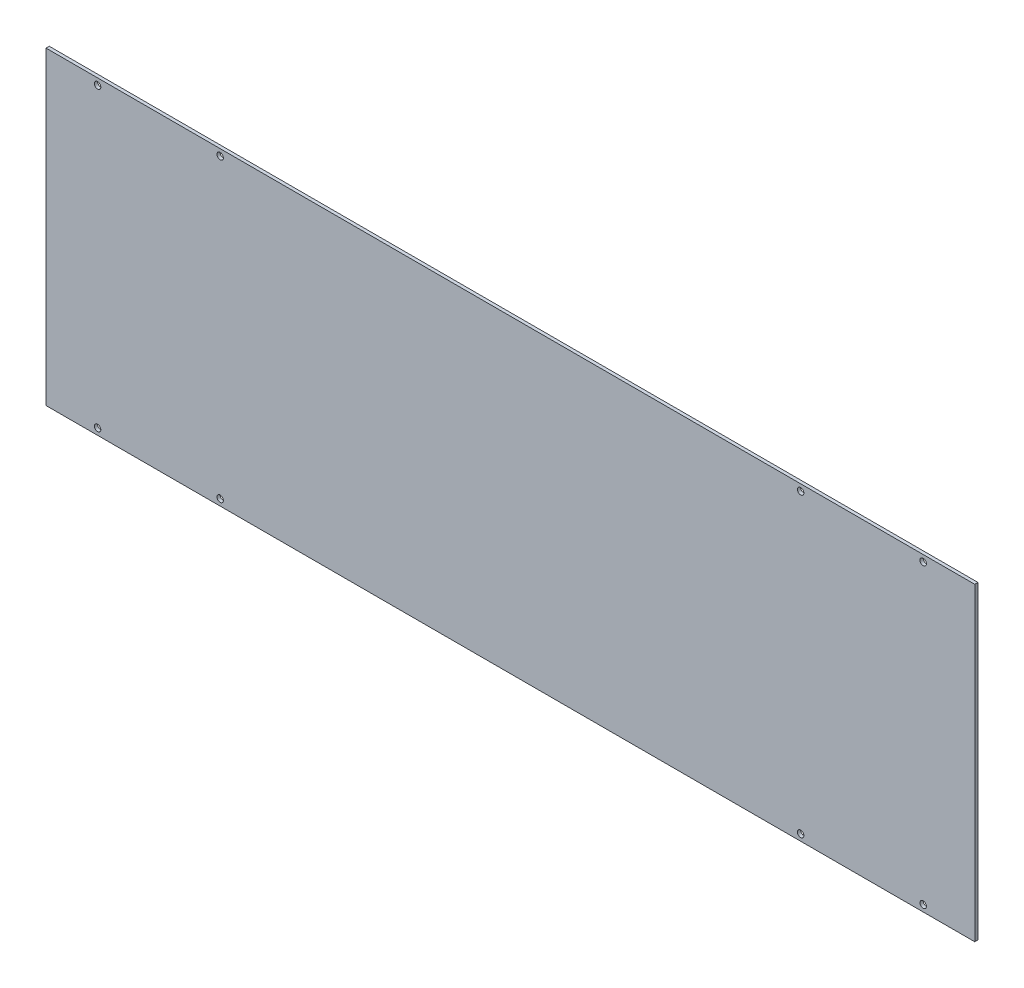
ISO-10303-21;
HEADER;
FILE_DESCRIPTION(('STEP AP214'),'2;1');
FILE_NAME('part.step','',(''),(''),'','','');
FILE_SCHEMA(('AUTOMOTIVE_DESIGN { 1 0 10303 214 1 1 1 1 }'));
ENDSEC;
DATA;
#1=APPLICATION_CONTEXT('core data for automotive mechanical design processes');
#2=APPLICATION_PROTOCOL_DEFINITION('international standard','automotive_design',2000,#1);
#3=PRODUCT_CONTEXT('',#1,'mechanical');
#4=PRODUCT('Part','Part','',(#3));
#5=PRODUCT_RELATED_PRODUCT_CATEGORY('part','',(#4));
#6=PRODUCT_DEFINITION_FORMATION('','',#4);
#7=PRODUCT_DEFINITION_CONTEXT('part definition',#1,'design');
#8=PRODUCT_DEFINITION('design','',#6,#7);
#9=PRODUCT_DEFINITION_SHAPE('','',#8);
#10=(LENGTH_UNIT() NAMED_UNIT(*) SI_UNIT(.MILLI.,.METRE.));
#11=(NAMED_UNIT(*) PLANE_ANGLE_UNIT() SI_UNIT($,.RADIAN.));
#12=(NAMED_UNIT(*) SI_UNIT($,.STERADIAN.) SOLID_ANGLE_UNIT());
#13=UNCERTAINTY_MEASURE_WITH_UNIT(LENGTH_MEASURE(1.E-05),#10,'distance_accuracy_value','');
#14=(GEOMETRIC_REPRESENTATION_CONTEXT(3) GLOBAL_UNCERTAINTY_ASSIGNED_CONTEXT((#13)) GLOBAL_UNIT_ASSIGNED_CONTEXT((#10,
#11,#12)) REPRESENTATION_CONTEXT('',''));
#15=CARTESIAN_POINT('',(0.,0.,0.));
#16=DIRECTION('',(0.,0.,1.));
#17=DIRECTION('',(1.,0.,0.));
#18=AXIS2_PLACEMENT_3D('',#15,#16,#17);
#19=CARTESIAN_POINT('',(0.,0.,0.));
#20=DIRECTION('',(0.,0.,-1.));
#21=DIRECTION('',(-1.,0.,0.));
#22=AXIS2_PLACEMENT_3D('',#19,#20,#21);
#23=PLANE('',#22);
#24=CARTESIAN_POINT('',(-285.75,146.05,0.));
#25=DIRECTION('',(0.,0.,1.));
#26=DIRECTION('',(1.,0.,0.));
#27=AXIS2_PLACEMENT_3D('',#24,#25,#26);
#28=CIRCLE('',#27,3.17499999999998);
#29=CARTESIAN_POINT('',(-282.575,146.05,0.));
#30=VERTEX_POINT('',#29);
#31=EDGE_CURVE('E186',#30,#30,#28,.T.);
#32=ORIENTED_EDGE('',*,*,#31,.T.);
#33=EDGE_LOOP('',(#32));
#34=FACE_BOUND('',#33,.T.);
#35=CARTESIAN_POINT('',(-406.4,146.05,0.));
#36=DIRECTION('',(0.,0.,1.));
#37=DIRECTION('',(1.,0.,0.));
#38=AXIS2_PLACEMENT_3D('',#35,#36,#37);
#39=CIRCLE('',#38,3.17499999999998);
#40=CARTESIAN_POINT('',(-403.225,146.05,0.));
#41=VERTEX_POINT('',#40);
#42=EDGE_CURVE('E178',#41,#41,#39,.T.);
#43=ORIENTED_EDGE('',*,*,#42,.T.);
#44=EDGE_LOOP('',(#43));
#45=FACE_BOUND('',#44,.T.);
#46=DIRECTION('',(0.,1.,0.));
#47=VECTOR('',#46,1.);
#48=CARTESIAN_POINT('',(457.2,-152.4,0.));
#49=LINE('',#48,#47);
#50=CARTESIAN_POINT('',(457.2,-152.4,0.));
#51=VERTEX_POINT('',#50);
#52=CARTESIAN_POINT('',(457.2,152.4,0.));
#53=VERTEX_POINT('',#52);
#54=EDGE_CURVE('E108',#51,#53,#49,.T.);
#55=ORIENTED_EDGE('',*,*,#54,.F.);
#56=DIRECTION('',(1.,0.,0.));
#57=VECTOR('',#56,1.);
#58=CARTESIAN_POINT('',(-457.2,-152.4,0.));
#59=LINE('',#58,#57);
#60=CARTESIAN_POINT('',(-457.2,-152.4,0.));
#61=VERTEX_POINT('',#60);
#62=EDGE_CURVE('E79',#61,#51,#59,.T.);
#63=ORIENTED_EDGE('',*,*,#62,.F.);
#64=DIRECTION('',(0.,-1.,0.));
#65=VECTOR('',#64,1.);
#66=CARTESIAN_POINT('',(-457.2,-152.4,0.));
#67=LINE('',#66,#65);
#68=CARTESIAN_POINT('',(-457.2,152.4,0.));
#69=VERTEX_POINT('',#68);
#70=EDGE_CURVE('E73',#69,#61,#67,.T.);
#71=ORIENTED_EDGE('',*,*,#70,.F.);
#72=DIRECTION('',(-1.,0.,0.));
#73=VECTOR('',#72,1.);
#74=CARTESIAN_POINT('',(-457.2,152.4,0.));
#75=LINE('',#74,#73);
#76=EDGE_CURVE('E96',#53,#69,#75,.T.);
#77=ORIENTED_EDGE('',*,*,#76,.F.);
#78=EDGE_LOOP('',(#55,#63,#71,#77));
#79=FACE_BOUND('',#78,.T.);
#80=CARTESIAN_POINT('',(285.75,-146.05,0.));
#81=DIRECTION('',(0.,0.,1.));
#82=DIRECTION('',(1.,0.,0.));
#83=AXIS2_PLACEMENT_3D('',#80,#81,#82);
#84=CIRCLE('',#83,3.17499999999998);
#85=CARTESIAN_POINT('',(288.925,-146.05,0.));
#86=VERTEX_POINT('',#85);
#87=EDGE_CURVE('E112',#86,#86,#84,.T.);
#88=ORIENTED_EDGE('',*,*,#87,.T.);
#89=EDGE_LOOP('',(#88));
#90=FACE_BOUND('',#89,.T.);
#91=CARTESIAN_POINT('',(406.4,-146.05,0.));
#92=DIRECTION('',(0.,0.,1.));
#93=DIRECTION('',(1.,0.,0.));
#94=AXIS2_PLACEMENT_3D('',#91,#92,#93);
#95=CIRCLE('',#94,3.17499999999998);
#96=CARTESIAN_POINT('',(409.575,-146.05,0.));
#97=VERTEX_POINT('',#96);
#98=EDGE_CURVE('E138',#97,#97,#95,.T.);
#99=ORIENTED_EDGE('',*,*,#98,.T.);
#100=EDGE_LOOP('',(#99));
#101=FACE_BOUND('',#100,.T.);
#102=CARTESIAN_POINT('',(406.4,146.05,0.));
#103=DIRECTION('',(0.,0.,1.));
#104=DIRECTION('',(1.,0.,0.));
#105=AXIS2_PLACEMENT_3D('',#102,#103,#104);
#106=CIRCLE('',#105,3.17499999999998);
#107=CARTESIAN_POINT('',(409.575,146.05,0.));
#108=VERTEX_POINT('',#107);
#109=EDGE_CURVE('E146',#108,#108,#106,.T.);
#110=ORIENTED_EDGE('',*,*,#109,.T.);
#111=EDGE_LOOP('',(#110));
#112=FACE_BOUND('',#111,.T.);
#113=CARTESIAN_POINT('',(285.75,146.05,0.));
#114=DIRECTION('',(0.,0.,1.));
#115=DIRECTION('',(1.,0.,0.));
#116=AXIS2_PLACEMENT_3D('',#113,#114,#115);
#117=CIRCLE('',#116,3.17499999999998);
#118=CARTESIAN_POINT('',(288.925,146.05,0.));
#119=VERTEX_POINT('',#118);
#120=EDGE_CURVE('E154',#119,#119,#117,.T.);
#121=ORIENTED_EDGE('',*,*,#120,.T.);
#122=EDGE_LOOP('',(#121));
#123=FACE_BOUND('',#122,.T.);
#124=CARTESIAN_POINT('',(-285.75,-146.05,0.));
#125=DIRECTION('',(0.,0.,1.));
#126=DIRECTION('',(1.,0.,0.));
#127=AXIS2_PLACEMENT_3D('',#124,#125,#126);
#128=CIRCLE('',#127,3.17499999999998);
#129=CARTESIAN_POINT('',(-282.575,-146.05,0.));
#130=VERTEX_POINT('',#129);
#131=EDGE_CURVE('E162',#130,#130,#128,.T.);
#132=ORIENTED_EDGE('',*,*,#131,.T.);
#133=EDGE_LOOP('',(#132));
#134=FACE_BOUND('',#133,.T.);
#135=CARTESIAN_POINT('',(-406.4,-146.05,0.));
#136=DIRECTION('',(0.,0.,1.));
#137=DIRECTION('',(1.,0.,0.));
#138=AXIS2_PLACEMENT_3D('',#135,#136,#137);
#139=CIRCLE('',#138,3.17499999999998);
#140=CARTESIAN_POINT('',(-403.225,-146.05,0.));
#141=VERTEX_POINT('',#140);
#142=EDGE_CURVE('E170',#141,#141,#139,.T.);
#143=ORIENTED_EDGE('',*,*,#142,.T.);
#144=EDGE_LOOP('',(#143));
#145=FACE_BOUND('',#144,.T.);
#146=ADVANCED_FACE('F38',(#34,#45,#79,#90,#101,#112,#123,#134,#145),#23,.T.);
#147=CARTESIAN_POINT('',(457.2,-152.4,3.175));
#148=DIRECTION('',(-1.,0.,0.));
#149=DIRECTION('',(0.,0.,1.));
#150=AXIS2_PLACEMENT_3D('',#147,#148,#149);
#151=PLANE('',#150);
#152=ORIENTED_EDGE('',*,*,#54,.T.);
#153=DIRECTION('',(0.,0.,-1.));
#154=VECTOR('',#153,1.);
#155=CARTESIAN_POINT('',(457.2,152.4,3.175));
#156=LINE('',#155,#154);
#157=CARTESIAN_POINT('',(457.2,152.4,3.175));
#158=VERTEX_POINT('',#157);
#159=EDGE_CURVE('E11',#158,#53,#156,.T.);
#160=ORIENTED_EDGE('',*,*,#159,.F.);
#161=DIRECTION('',(0.,1.,0.));
#162=VECTOR('',#161,1.);
#163=CARTESIAN_POINT('',(457.2,-152.4,3.175));
#164=LINE('',#163,#162);
#165=CARTESIAN_POINT('',(457.2,-152.4,3.175));
#166=VERTEX_POINT('',#165);
#167=EDGE_CURVE('E91',#166,#158,#164,.T.);
#168=ORIENTED_EDGE('',*,*,#167,.F.);
#169=DIRECTION('',(0.,0.,-1.));
#170=VECTOR('',#169,1.);
#171=CARTESIAN_POINT('',(457.2,-152.4,3.175));
#172=LINE('',#171,#170);
#173=EDGE_CURVE('E104',#166,#51,#172,.T.);
#174=ORIENTED_EDGE('',*,*,#173,.T.);
#175=EDGE_LOOP('',(#152,#160,#168,#174));
#176=FACE_BOUND('',#175,.T.);
#177=ADVANCED_FACE('F40',(#176),#151,.F.);
#178=CARTESIAN_POINT('',(-457.2,152.4,3.175));
#179=DIRECTION('',(0.,-1.,0.));
#180=DIRECTION('',(0.,0.,-1.));
#181=AXIS2_PLACEMENT_3D('',#178,#179,#180);
#182=PLANE('',#181);
#183=ORIENTED_EDGE('',*,*,#76,.T.);
#184=DIRECTION('',(0.,0.,-1.));
#185=VECTOR('',#184,1.);
#186=CARTESIAN_POINT('',(-457.2,152.4,3.175));
#187=LINE('',#186,#185);
#188=CARTESIAN_POINT('',(-457.2,152.4,3.175));
#189=VERTEX_POINT('',#188);
#190=EDGE_CURVE('E48',#189,#69,#187,.T.);
#191=ORIENTED_EDGE('',*,*,#190,.F.);
#192=DIRECTION('',(-1.,0.,0.));
#193=VECTOR('',#192,1.);
#194=CARTESIAN_POINT('',(-457.2,152.4,3.175));
#195=LINE('',#194,#193);
#196=EDGE_CURVE('E86',#158,#189,#195,.T.);
#197=ORIENTED_EDGE('',*,*,#196,.F.);
#198=ORIENTED_EDGE('',*,*,#159,.T.);
#199=EDGE_LOOP('',(#183,#191,#197,#198));
#200=FACE_BOUND('',#199,.T.);
#201=ADVANCED_FACE('F95',(#200),#182,.F.);
#202=CARTESIAN_POINT('',(-457.2,-152.4,3.175));
#203=DIRECTION('',(1.,0.,0.));
#204=DIRECTION('',(0.,0.,-1.));
#205=AXIS2_PLACEMENT_3D('',#202,#203,#204);
#206=PLANE('',#205);
#207=ORIENTED_EDGE('',*,*,#70,.T.);
#208=DIRECTION('',(0.,0.,-1.));
#209=VECTOR('',#208,1.);
#210=CARTESIAN_POINT('',(-457.2,-152.4,3.175));
#211=LINE('',#210,#209);
#212=CARTESIAN_POINT('',(-457.2,-152.4,3.175));
#213=VERTEX_POINT('',#212);
#214=EDGE_CURVE('E98',#213,#61,#211,.T.);
#215=ORIENTED_EDGE('',*,*,#214,.F.);
#216=DIRECTION('',(0.,-1.,0.));
#217=VECTOR('',#216,1.);
#218=CARTESIAN_POINT('',(-457.2,-152.4,3.175));
#219=LINE('',#218,#217);
#220=EDGE_CURVE('E89',#189,#213,#219,.T.);
#221=ORIENTED_EDGE('',*,*,#220,.F.);
#222=ORIENTED_EDGE('',*,*,#190,.T.);
#223=EDGE_LOOP('',(#207,#215,#221,#222));
#224=FACE_BOUND('',#223,.T.);
#225=ADVANCED_FACE('F99',(#224),#206,.F.);
#226=CARTESIAN_POINT('',(-457.2,-152.4,3.175));
#227=DIRECTION('',(0.,1.,0.));
#228=DIRECTION('',(0.,0.,1.));
#229=AXIS2_PLACEMENT_3D('',#226,#227,#228);
#230=PLANE('',#229);
#231=ORIENTED_EDGE('',*,*,#62,.T.);
#232=ORIENTED_EDGE('',*,*,#173,.F.);
#233=DIRECTION('',(1.,0.,0.));
#234=VECTOR('',#233,1.);
#235=CARTESIAN_POINT('',(-457.2,-152.4,3.175));
#236=LINE('',#235,#234);
#237=EDGE_CURVE('E56',#213,#166,#236,.T.);
#238=ORIENTED_EDGE('',*,*,#237,.F.);
#239=ORIENTED_EDGE('',*,*,#214,.T.);
#240=EDGE_LOOP('',(#231,#232,#238,#239));
#241=FACE_BOUND('',#240,.T.);
#242=ADVANCED_FACE('F123',(#241),#230,.F.);
#243=CARTESIAN_POINT('',(0.,0.,3.175));
#244=DIRECTION('',(0.,0.,-1.));
#245=DIRECTION('',(-1.,0.,0.));
#246=AXIS2_PLACEMENT_3D('',#243,#244,#245);
#247=PLANE('',#246);
#248=CARTESIAN_POINT('',(-285.75,146.05,3.175));
#249=DIRECTION('',(0.,0.,1.));
#250=DIRECTION('',(1.,0.,0.));
#251=AXIS2_PLACEMENT_3D('',#248,#249,#250);
#252=CIRCLE('',#251,3.17499999999998);
#253=CARTESIAN_POINT('',(-282.575,146.05,3.175));
#254=VERTEX_POINT('',#253);
#255=EDGE_CURVE('E190',#254,#254,#252,.T.);
#256=ORIENTED_EDGE('',*,*,#255,.F.);
#257=EDGE_LOOP('',(#256));
#258=FACE_BOUND('',#257,.T.);
#259=CARTESIAN_POINT('',(-406.4,146.05,3.175));
#260=DIRECTION('',(0.,0.,1.));
#261=DIRECTION('',(1.,0.,0.));
#262=AXIS2_PLACEMENT_3D('',#259,#260,#261);
#263=CIRCLE('',#262,3.17499999999998);
#264=CARTESIAN_POINT('',(-403.225,146.05,3.175));
#265=VERTEX_POINT('',#264);
#266=EDGE_CURVE('E182',#265,#265,#263,.T.);
#267=ORIENTED_EDGE('',*,*,#266,.F.);
#268=EDGE_LOOP('',(#267));
#269=FACE_BOUND('',#268,.T.);
#270=CARTESIAN_POINT('',(-406.4,-146.05,3.175));
#271=DIRECTION('',(0.,0.,1.));
#272=DIRECTION('',(1.,0.,0.));
#273=AXIS2_PLACEMENT_3D('',#270,#271,#272);
#274=CIRCLE('',#273,3.17499999999998);
#275=CARTESIAN_POINT('',(-403.225,-146.05,3.175));
#276=VERTEX_POINT('',#275);
#277=EDGE_CURVE('E174',#276,#276,#274,.T.);
#278=ORIENTED_EDGE('',*,*,#277,.F.);
#279=EDGE_LOOP('',(#278));
#280=FACE_BOUND('',#279,.T.);
#281=CARTESIAN_POINT('',(-285.75,-146.05,3.175));
#282=DIRECTION('',(0.,0.,1.));
#283=DIRECTION('',(1.,0.,0.));
#284=AXIS2_PLACEMENT_3D('',#281,#282,#283);
#285=CIRCLE('',#284,3.17499999999998);
#286=CARTESIAN_POINT('',(-282.575,-146.05,3.175));
#287=VERTEX_POINT('',#286);
#288=EDGE_CURVE('E166',#287,#287,#285,.T.);
#289=ORIENTED_EDGE('',*,*,#288,.F.);
#290=EDGE_LOOP('',(#289));
#291=FACE_BOUND('',#290,.T.);
#292=CARTESIAN_POINT('',(285.75,146.05,3.175));
#293=DIRECTION('',(0.,0.,1.));
#294=DIRECTION('',(1.,0.,0.));
#295=AXIS2_PLACEMENT_3D('',#292,#293,#294);
#296=CIRCLE('',#295,3.17499999999998);
#297=CARTESIAN_POINT('',(288.925,146.05,3.175));
#298=VERTEX_POINT('',#297);
#299=EDGE_CURVE('E158',#298,#298,#296,.T.);
#300=ORIENTED_EDGE('',*,*,#299,.F.);
#301=EDGE_LOOP('',(#300));
#302=FACE_BOUND('',#301,.T.);
#303=CARTESIAN_POINT('',(406.4,146.05,3.175));
#304=DIRECTION('',(0.,0.,1.));
#305=DIRECTION('',(1.,0.,0.));
#306=AXIS2_PLACEMENT_3D('',#303,#304,#305);
#307=CIRCLE('',#306,3.17499999999998);
#308=CARTESIAN_POINT('',(409.575,146.05,3.175));
#309=VERTEX_POINT('',#308);
#310=EDGE_CURVE('E150',#309,#309,#307,.T.);
#311=ORIENTED_EDGE('',*,*,#310,.F.);
#312=EDGE_LOOP('',(#311));
#313=FACE_BOUND('',#312,.T.);
#314=CARTESIAN_POINT('',(406.4,-146.05,3.175));
#315=DIRECTION('',(0.,0.,1.));
#316=DIRECTION('',(1.,0.,0.));
#317=AXIS2_PLACEMENT_3D('',#314,#315,#316);
#318=CIRCLE('',#317,3.17499999999998);
#319=CARTESIAN_POINT('',(409.575,-146.05,3.175));
#320=VERTEX_POINT('',#319);
#321=EDGE_CURVE('E142',#320,#320,#318,.T.);
#322=ORIENTED_EDGE('',*,*,#321,.F.);
#323=EDGE_LOOP('',(#322));
#324=FACE_BOUND('',#323,.T.);
#325=CARTESIAN_POINT('',(285.75,-146.05,3.175));
#326=DIRECTION('',(0.,0.,1.));
#327=DIRECTION('',(1.,0.,0.));
#328=AXIS2_PLACEMENT_3D('',#325,#326,#327);
#329=CIRCLE('',#328,3.17499999999998);
#330=CARTESIAN_POINT('',(288.925,-146.05,3.175));
#331=VERTEX_POINT('',#330);
#332=EDGE_CURVE('E134',#331,#331,#329,.T.);
#333=ORIENTED_EDGE('',*,*,#332,.F.);
#334=EDGE_LOOP('',(#333));
#335=FACE_BOUND('',#334,.T.);
#336=ORIENTED_EDGE('',*,*,#167,.T.);
#337=ORIENTED_EDGE('',*,*,#196,.T.);
#338=ORIENTED_EDGE('',*,*,#220,.T.);
#339=ORIENTED_EDGE('',*,*,#237,.T.);
#340=EDGE_LOOP('',(#336,#337,#338,#339));
#341=FACE_BOUND('',#340,.T.);
#342=ADVANCED_FACE('F87',(#258,#269,#280,#291,#302,#313,#324,#335,#341),#247,.F.);
#343=CARTESIAN_POINT('',(285.75,-146.05,3.175));
#344=DIRECTION('',(0.,0.,1.));
#345=DIRECTION('',(1.,0.,0.));
#346=AXIS2_PLACEMENT_3D('',#343,#344,#345);
#347=CYLINDRICAL_SURFACE('',#346,3.17499999999998);
#348=ORIENTED_EDGE('',*,*,#87,.F.);
#349=EDGE_LOOP('',(#348));
#350=FACE_BOUND('',#349,.T.);
#351=ORIENTED_EDGE('',*,*,#332,.T.);
#352=EDGE_LOOP('',(#351));
#353=FACE_BOUND('',#352,.T.);
#354=ADVANCED_FACE('F200',(#350,#353),#347,.F.);
#355=CARTESIAN_POINT('',(406.4,-146.05,3.175));
#356=DIRECTION('',(0.,0.,1.));
#357=DIRECTION('',(1.,0.,0.));
#358=AXIS2_PLACEMENT_3D('',#355,#356,#357);
#359=CYLINDRICAL_SURFACE('',#358,3.17499999999998);
#360=ORIENTED_EDGE('',*,*,#98,.F.);
#361=EDGE_LOOP('',(#360));
#362=FACE_BOUND('',#361,.T.);
#363=ORIENTED_EDGE('',*,*,#321,.T.);
#364=EDGE_LOOP('',(#363));
#365=FACE_BOUND('',#364,.T.);
#366=ADVANCED_FACE('F217',(#362,#365),#359,.F.);
#367=CARTESIAN_POINT('',(406.4,146.05,3.175));
#368=DIRECTION('',(0.,0.,1.));
#369=DIRECTION('',(1.,0.,0.));
#370=AXIS2_PLACEMENT_3D('',#367,#368,#369);
#371=CYLINDRICAL_SURFACE('',#370,3.17499999999998);
#372=ORIENTED_EDGE('',*,*,#109,.F.);
#373=EDGE_LOOP('',(#372));
#374=FACE_BOUND('',#373,.T.);
#375=ORIENTED_EDGE('',*,*,#310,.T.);
#376=EDGE_LOOP('',(#375));
#377=FACE_BOUND('',#376,.T.);
#378=ADVANCED_FACE('F223',(#374,#377),#371,.F.);
#379=CARTESIAN_POINT('',(285.75,146.05,3.175));
#380=DIRECTION('',(0.,0.,1.));
#381=DIRECTION('',(1.,0.,0.));
#382=AXIS2_PLACEMENT_3D('',#379,#380,#381);
#383=CYLINDRICAL_SURFACE('',#382,3.17499999999998);
#384=ORIENTED_EDGE('',*,*,#120,.F.);
#385=EDGE_LOOP('',(#384));
#386=FACE_BOUND('',#385,.T.);
#387=ORIENTED_EDGE('',*,*,#299,.T.);
#388=EDGE_LOOP('',(#387));
#389=FACE_BOUND('',#388,.T.);
#390=ADVANCED_FACE('F276',(#386,#389),#383,.F.);
#391=CARTESIAN_POINT('',(-285.75,-146.05,3.175));
#392=DIRECTION('',(0.,0.,1.));
#393=DIRECTION('',(1.,0.,0.));
#394=AXIS2_PLACEMENT_3D('',#391,#392,#393);
#395=CYLINDRICAL_SURFACE('',#394,3.17499999999998);
#396=ORIENTED_EDGE('',*,*,#131,.F.);
#397=EDGE_LOOP('',(#396));
#398=FACE_BOUND('',#397,.T.);
#399=ORIENTED_EDGE('',*,*,#288,.T.);
#400=EDGE_LOOP('',(#399));
#401=FACE_BOUND('',#400,.T.);
#402=ADVANCED_FACE('F286',(#398,#401),#395,.F.);
#403=CARTESIAN_POINT('',(-406.4,-146.05,3.175));
#404=DIRECTION('',(0.,0.,1.));
#405=DIRECTION('',(1.,0.,0.));
#406=AXIS2_PLACEMENT_3D('',#403,#404,#405);
#407=CYLINDRICAL_SURFACE('',#406,3.17499999999998);
#408=ORIENTED_EDGE('',*,*,#142,.F.);
#409=EDGE_LOOP('',(#408));
#410=FACE_BOUND('',#409,.T.);
#411=ORIENTED_EDGE('',*,*,#277,.T.);
#412=EDGE_LOOP('',(#411));
#413=FACE_BOUND('',#412,.T.);
#414=ADVANCED_FACE('F295',(#410,#413),#407,.F.);
#415=CARTESIAN_POINT('',(-406.4,146.05,3.175));
#416=DIRECTION('',(0.,0.,1.));
#417=DIRECTION('',(1.,0.,0.));
#418=AXIS2_PLACEMENT_3D('',#415,#416,#417);
#419=CYLINDRICAL_SURFACE('',#418,3.17499999999998);
#420=ORIENTED_EDGE('',*,*,#42,.F.);
#421=EDGE_LOOP('',(#420));
#422=FACE_BOUND('',#421,.T.);
#423=ORIENTED_EDGE('',*,*,#266,.T.);
#424=EDGE_LOOP('',(#423));
#425=FACE_BOUND('',#424,.T.);
#426=ADVANCED_FACE('F305',(#422,#425),#419,.F.);
#427=CARTESIAN_POINT('',(-285.75,146.05,3.175));
#428=DIRECTION('',(0.,0.,1.));
#429=DIRECTION('',(1.,0.,0.));
#430=AXIS2_PLACEMENT_3D('',#427,#428,#429);
#431=CYLINDRICAL_SURFACE('',#430,3.17499999999998);
#432=ORIENTED_EDGE('',*,*,#31,.F.);
#433=EDGE_LOOP('',(#432));
#434=FACE_BOUND('',#433,.T.);
#435=ORIENTED_EDGE('',*,*,#255,.T.);
#436=EDGE_LOOP('',(#435));
#437=FACE_BOUND('',#436,.T.);
#438=ADVANCED_FACE('F196',(#434,#437),#431,.F.);
#439=CLOSED_SHELL('',(#146,#177,#201,#225,#242,#342,#354,#366,#378,#390,#402,#414,#426,#438));
#440=MANIFOLD_SOLID_BREP('B2',#439);
#441=ADVANCED_BREP_SHAPE_REPRESENTATION('',(#18,#440),#14);
#442=SHAPE_DEFINITION_REPRESENTATION(#9,#441);
ENDSEC;
END-ISO-10303-21;
